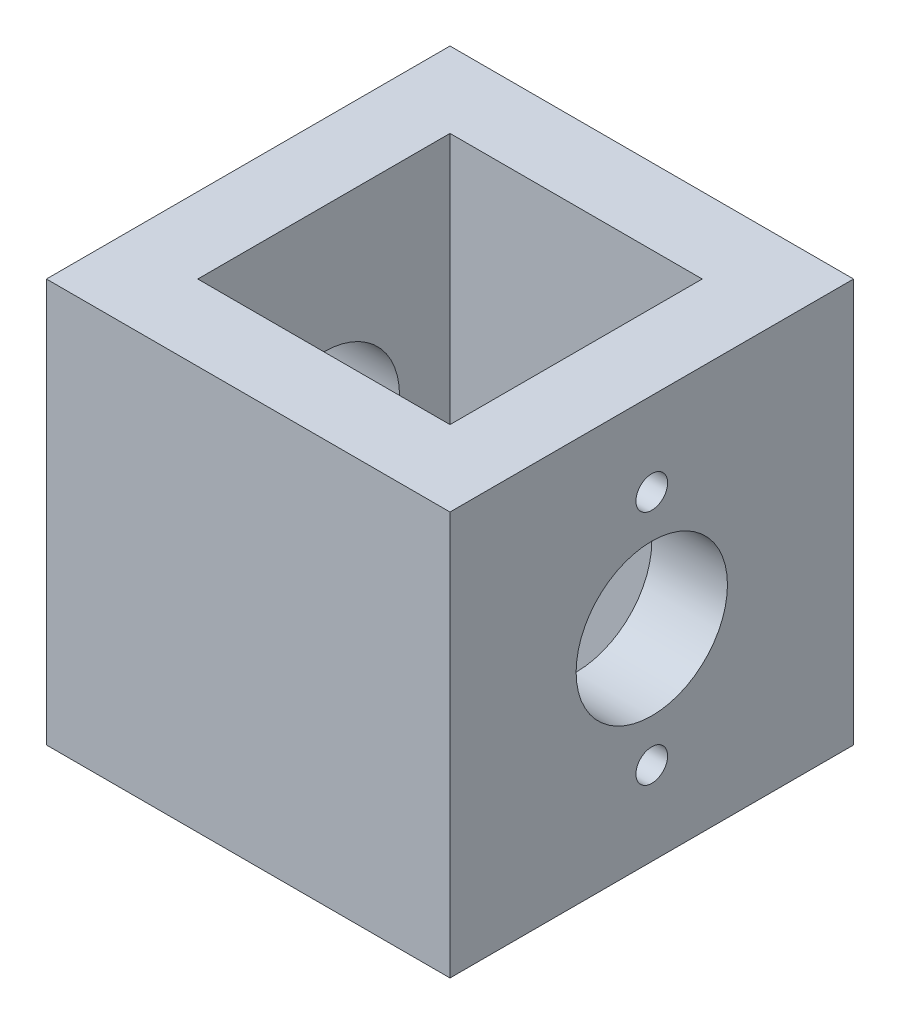
ISO-10303-21;
HEADER;
FILE_DESCRIPTION(('STEP AP214'),'2;1');
FILE_NAME('part.step','',(''),(''),'','','');
FILE_SCHEMA(('AUTOMOTIVE_DESIGN { 1 0 10303 214 1 1 1 1 }'));
ENDSEC;
DATA;
#1=APPLICATION_CONTEXT('core data for automotive mechanical design processes');
#2=APPLICATION_PROTOCOL_DEFINITION('international standard','automotive_design',2000,#1);
#3=PRODUCT_CONTEXT('',#1,'mechanical');
#4=PRODUCT('Part','Part','',(#3));
#5=PRODUCT_RELATED_PRODUCT_CATEGORY('part','',(#4));
#6=PRODUCT_DEFINITION_FORMATION('','',#4);
#7=PRODUCT_DEFINITION_CONTEXT('part definition',#1,'design');
#8=PRODUCT_DEFINITION('design','',#6,#7);
#9=PRODUCT_DEFINITION_SHAPE('','',#8);
#10=(LENGTH_UNIT() NAMED_UNIT(*) SI_UNIT(.MILLI.,.METRE.));
#11=(NAMED_UNIT(*) PLANE_ANGLE_UNIT() SI_UNIT($,.RADIAN.));
#12=(NAMED_UNIT(*) SI_UNIT($,.STERADIAN.) SOLID_ANGLE_UNIT());
#13=UNCERTAINTY_MEASURE_WITH_UNIT(LENGTH_MEASURE(1.E-05),#10,'distance_accuracy_value','');
#14=(GEOMETRIC_REPRESENTATION_CONTEXT(3) GLOBAL_UNCERTAINTY_ASSIGNED_CONTEXT((#13)) GLOBAL_UNIT_ASSIGNED_CONTEXT((#10,
#11,#12)) REPRESENTATION_CONTEXT('',''));
#15=CARTESIAN_POINT('',(0.,0.,0.));
#16=DIRECTION('',(0.,0.,1.));
#17=DIRECTION('',(1.,0.,0.));
#18=AXIS2_PLACEMENT_3D('',#15,#16,#17);
#19=CARTESIAN_POINT('',(0.,25.4,0.));
#20=DIRECTION('',(1.,0.,0.));
#21=DIRECTION('',(0.,0.,-1.));
#22=AXIS2_PLACEMENT_3D('',#19,#20,#21);
#23=PLANE('',#22);
#24=CARTESIAN_POINT('',(0.,12.7,-12.7));
#25=DIRECTION('',(1.,0.,0.));
#26=DIRECTION('',(0.,0.,-1.));
#27=AXIS2_PLACEMENT_3D('',#24,#25,#26);
#28=CIRCLE('',#27,4.7625);
#29=CARTESIAN_POINT('',(0.,12.7,-17.4625));
#30=VERTEX_POINT('',#29);
#31=EDGE_CURVE('E308',#30,#30,#28,.T.);
#32=ORIENTED_EDGE('',*,*,#31,.T.);
#33=EDGE_LOOP('',(#32));
#34=FACE_BOUND('',#33,.T.);
#35=DIRECTION('',(0.,0.,1.));
#36=VECTOR('',#35,1.);
#37=CARTESIAN_POINT('',(0.,0.,0.));
#38=LINE('',#37,#36);
#39=CARTESIAN_POINT('',(0.,0.,-25.4));
#40=VERTEX_POINT('',#39);
#41=CARTESIAN_POINT('',(0.,0.,0.));
#42=VERTEX_POINT('',#41);
#43=EDGE_CURVE('E166',#40,#42,#38,.T.);
#44=ORIENTED_EDGE('',*,*,#43,.T.);
#45=DIRECTION('',(0.,-1.,0.));
#46=VECTOR('',#45,1.);
#47=CARTESIAN_POINT('',(0.,25.4,0.));
#48=LINE('',#47,#46);
#49=CARTESIAN_POINT('',(0.,25.4,0.));
#50=VERTEX_POINT('',#49);
#51=EDGE_CURVE('E11',#50,#42,#48,.T.);
#52=ORIENTED_EDGE('',*,*,#51,.F.);
#53=DIRECTION('',(0.,0.,1.));
#54=VECTOR('',#53,1.);
#55=CARTESIAN_POINT('',(0.,25.4,0.));
#56=LINE('',#55,#54);
#57=CARTESIAN_POINT('',(0.,25.4,-25.4));
#58=VERTEX_POINT('',#57);
#59=EDGE_CURVE('E172',#58,#50,#56,.T.);
#60=ORIENTED_EDGE('',*,*,#59,.F.);
#61=DIRECTION('',(0.,-1.,0.));
#62=VECTOR('',#61,1.);
#63=CARTESIAN_POINT('',(0.,25.4,-25.4));
#64=LINE('',#63,#62);
#65=EDGE_CURVE('E182',#58,#40,#64,.T.);
#66=ORIENTED_EDGE('',*,*,#65,.T.);
#67=EDGE_LOOP('',(#44,#52,#60,#66));
#68=FACE_BOUND('',#67,.T.);
#69=ADVANCED_FACE('F33',(#34,#68),#23,.F.);
#70=CARTESIAN_POINT('',(0.,25.4,0.));
#71=DIRECTION('',(0.,0.,-1.));
#72=DIRECTION('',(-1.,0.,0.));
#73=AXIS2_PLACEMENT_3D('',#70,#71,#72);
#74=PLANE('',#73);
#75=DIRECTION('',(1.,0.,0.));
#76=VECTOR('',#75,1.);
#77=CARTESIAN_POINT('',(0.,0.,0.));
#78=LINE('',#77,#76);
#79=CARTESIAN_POINT('',(25.4,0.,0.));
#80=VERTEX_POINT('',#79);
#81=EDGE_CURVE('E185',#42,#80,#78,.T.);
#82=ORIENTED_EDGE('',*,*,#81,.T.);
#83=DIRECTION('',(0.,-1.,0.));
#84=VECTOR('',#83,1.);
#85=CARTESIAN_POINT('',(25.4,25.4,0.));
#86=LINE('',#85,#84);
#87=CARTESIAN_POINT('',(25.4,25.4,0.));
#88=VERTEX_POINT('',#87);
#89=EDGE_CURVE('E41',#88,#80,#86,.T.);
#90=ORIENTED_EDGE('',*,*,#89,.F.);
#91=DIRECTION('',(1.,0.,0.));
#92=VECTOR('',#91,1.);
#93=CARTESIAN_POINT('',(0.,25.4,0.));
#94=LINE('',#93,#92);
#95=EDGE_CURVE('E175',#50,#88,#94,.T.);
#96=ORIENTED_EDGE('',*,*,#95,.F.);
#97=ORIENTED_EDGE('',*,*,#51,.T.);
#98=EDGE_LOOP('',(#82,#90,#96,#97));
#99=FACE_BOUND('',#98,.T.);
#100=ADVANCED_FACE('F216',(#99),#74,.F.);
#101=CARTESIAN_POINT('',(25.4,25.4,0.));
#102=DIRECTION('',(-1.,0.,0.));
#103=DIRECTION('',(0.,0.,1.));
#104=AXIS2_PLACEMENT_3D('',#101,#102,#103);
#105=PLANE('',#104);
#106=CARTESIAN_POINT('',(25.4,20.1422,-12.7));
#107=DIRECTION('',(1.,0.,0.));
#108=DIRECTION('',(0.,0.,-1.));
#109=AXIS2_PLACEMENT_3D('',#106,#107,#108);
#110=CIRCLE('',#109,0.99694999999999);
#111=CARTESIAN_POINT('',(25.4,20.1422,-13.69695));
#112=VERTEX_POINT('',#111);
#113=EDGE_CURVE('E295',#112,#112,#110,.T.);
#114=ORIENTED_EDGE('',*,*,#113,.F.);
#115=EDGE_LOOP('',(#114));
#116=FACE_BOUND('',#115,.T.);
#117=CARTESIAN_POINT('',(25.4,5.2578,-12.7));
#118=DIRECTION('',(1.,0.,0.));
#119=DIRECTION('',(0.,0.,-1.));
#120=AXIS2_PLACEMENT_3D('',#117,#118,#119);
#121=CIRCLE('',#120,0.996949999999988);
#122=CARTESIAN_POINT('',(25.4,5.2578,-13.69695));
#123=VERTEX_POINT('',#122);
#124=EDGE_CURVE('E297',#123,#123,#121,.T.);
#125=ORIENTED_EDGE('',*,*,#124,.F.);
#126=EDGE_LOOP('',(#125));
#127=FACE_BOUND('',#126,.T.);
#128=CARTESIAN_POINT('',(25.4,12.7,-12.7));
#129=DIRECTION('',(1.,0.,0.));
#130=DIRECTION('',(0.,0.,-1.));
#131=AXIS2_PLACEMENT_3D('',#128,#129,#130);
#132=CIRCLE('',#131,4.76249999999999);
#133=CARTESIAN_POINT('',(25.4,12.7,-17.4625));
#134=VERTEX_POINT('',#133);
#135=EDGE_CURVE('E305',#134,#134,#132,.T.);
#136=ORIENTED_EDGE('',*,*,#135,.F.);
#137=EDGE_LOOP('',(#136));
#138=FACE_BOUND('',#137,.T.);
#139=DIRECTION('',(0.,0.,-1.));
#140=VECTOR('',#139,1.);
#141=CARTESIAN_POINT('',(25.4,0.,0.));
#142=LINE('',#141,#140);
#143=CARTESIAN_POINT('',(25.4,0.,-25.4));
#144=VERTEX_POINT('',#143);
#145=EDGE_CURVE('E187',#80,#144,#142,.T.);
#146=ORIENTED_EDGE('',*,*,#145,.T.);
#147=DIRECTION('',(0.,-1.,0.));
#148=VECTOR('',#147,1.);
#149=CARTESIAN_POINT('',(25.4,25.4,-25.4));
#150=LINE('',#149,#148);
#151=CARTESIAN_POINT('',(25.4,25.4,-25.4));
#152=VERTEX_POINT('',#151);
#153=EDGE_CURVE('E192',#152,#144,#150,.T.);
#154=ORIENTED_EDGE('',*,*,#153,.F.);
#155=DIRECTION('',(0.,0.,-1.));
#156=VECTOR('',#155,1.);
#157=CARTESIAN_POINT('',(25.4,25.4,0.));
#158=LINE('',#157,#156);
#159=EDGE_CURVE('E178',#88,#152,#158,.T.);
#160=ORIENTED_EDGE('',*,*,#159,.F.);
#161=ORIENTED_EDGE('',*,*,#89,.T.);
#162=EDGE_LOOP('',(#146,#154,#160,#161));
#163=FACE_BOUND('',#162,.T.);
#164=ADVANCED_FACE('F200',(#116,#127,#138,#163),#105,.F.);
#165=CARTESIAN_POINT('',(0.,25.4,-25.4));
#166=DIRECTION('',(0.,0.,1.));
#167=DIRECTION('',(1.,0.,0.));
#168=AXIS2_PLACEMENT_3D('',#165,#166,#167);
#169=PLANE('',#168);
#170=DIRECTION('',(-1.,0.,0.));
#171=VECTOR('',#170,1.);
#172=CARTESIAN_POINT('',(0.,0.,-25.4));
#173=LINE('',#172,#171);
#174=EDGE_CURVE('E176',#144,#40,#173,.T.);
#175=ORIENTED_EDGE('',*,*,#174,.T.);
#176=ORIENTED_EDGE('',*,*,#65,.F.);
#177=DIRECTION('',(-1.,0.,0.));
#178=VECTOR('',#177,1.);
#179=CARTESIAN_POINT('',(0.,25.4,-25.4));
#180=LINE('',#179,#178);
#181=EDGE_CURVE('E180',#152,#58,#180,.T.);
#182=ORIENTED_EDGE('',*,*,#181,.F.);
#183=ORIENTED_EDGE('',*,*,#153,.T.);
#184=EDGE_LOOP('',(#175,#176,#182,#183));
#185=FACE_BOUND('',#184,.T.);
#186=ADVANCED_FACE('F209',(#185),#169,.F.);
#187=CARTESIAN_POINT('',(0.,25.4,0.));
#188=DIRECTION('',(0.,-1.,0.));
#189=DIRECTION('',(0.,0.,-1.));
#190=AXIS2_PLACEMENT_3D('',#187,#188,#189);
#191=PLANE('',#190);
#192=DIRECTION('',(-1.,0.,0.));
#193=VECTOR('',#192,1.);
#194=CARTESIAN_POINT('',(4.7625,25.4,-20.6375));
#195=LINE('',#194,#193);
#196=CARTESIAN_POINT('',(20.6375,25.4,-20.6375));
#197=VERTEX_POINT('',#196);
#198=CARTESIAN_POINT('',(4.7625,25.4,-20.6375));
#199=VERTEX_POINT('',#198);
#200=EDGE_CURVE('E156',#197,#199,#195,.T.);
#201=ORIENTED_EDGE('',*,*,#200,.F.);
#202=DIRECTION('',(0.,0.,-1.));
#203=VECTOR('',#202,1.);
#204=CARTESIAN_POINT('',(20.6375,25.4,-4.7625));
#205=LINE('',#204,#203);
#206=CARTESIAN_POINT('',(20.6375,25.4,-4.7625));
#207=VERTEX_POINT('',#206);
#208=EDGE_CURVE('E48',#207,#197,#205,.T.);
#209=ORIENTED_EDGE('',*,*,#208,.F.);
#210=DIRECTION('',(1.,0.,0.));
#211=VECTOR('',#210,1.);
#212=CARTESIAN_POINT('',(4.7625,25.4,-4.7625));
#213=LINE('',#212,#211);
#214=CARTESIAN_POINT('',(4.7625,25.4,-4.7625));
#215=VERTEX_POINT('',#214);
#216=EDGE_CURVE('E147',#215,#207,#213,.T.);
#217=ORIENTED_EDGE('',*,*,#216,.F.);
#218=DIRECTION('',(0.,0.,1.));
#219=VECTOR('',#218,1.);
#220=CARTESIAN_POINT('',(4.7625,25.4,-4.7625));
#221=LINE('',#220,#219);
#222=EDGE_CURVE('E159',#199,#215,#221,.T.);
#223=ORIENTED_EDGE('',*,*,#222,.F.);
#224=EDGE_LOOP('',(#201,#209,#217,#223));
#225=FACE_BOUND('',#224,.T.);
#226=ORIENTED_EDGE('',*,*,#59,.T.);
#227=ORIENTED_EDGE('',*,*,#95,.T.);
#228=ORIENTED_EDGE('',*,*,#159,.T.);
#229=ORIENTED_EDGE('',*,*,#181,.T.);
#230=EDGE_LOOP('',(#226,#227,#228,#229));
#231=FACE_BOUND('',#230,.T.);
#232=ADVANCED_FACE('F215',(#225,#231),#191,.F.);
#233=CARTESIAN_POINT('',(0.,0.,0.));
#234=DIRECTION('',(0.,-1.,0.));
#235=DIRECTION('',(0.,0.,-1.));
#236=AXIS2_PLACEMENT_3D('',#233,#234,#235);
#237=PLANE('',#236);
#238=CARTESIAN_POINT('',(2.54,0.,-2.54));
#239=DIRECTION('',(0.,-1.,0.));
#240=DIRECTION('',(0.,0.,-1.));
#241=AXIS2_PLACEMENT_3D('',#238,#239,#240);
#242=CIRCLE('',#241,1.13029999999999);
#243=CARTESIAN_POINT('',(2.54,0.,-3.67029999999999));
#244=VERTEX_POINT('',#243);
#245=EDGE_CURVE('E119',#244,#244,#242,.T.);
#246=ORIENTED_EDGE('',*,*,#245,.F.);
#247=EDGE_LOOP('',(#246));
#248=FACE_BOUND('',#247,.T.);
#249=CARTESIAN_POINT('',(22.86,0.,-2.54));
#250=DIRECTION('',(0.,-1.,0.));
#251=DIRECTION('',(0.,0.,-1.));
#252=AXIS2_PLACEMENT_3D('',#249,#250,#251);
#253=CIRCLE('',#252,1.13029999999999);
#254=CARTESIAN_POINT('',(22.86,0.,-3.67029999999999));
#255=VERTEX_POINT('',#254);
#256=EDGE_CURVE('E118',#255,#255,#253,.T.);
#257=ORIENTED_EDGE('',*,*,#256,.F.);
#258=EDGE_LOOP('',(#257));
#259=FACE_BOUND('',#258,.T.);
#260=CARTESIAN_POINT('',(22.86,0.,-22.86));
#261=DIRECTION('',(0.,-1.,0.));
#262=DIRECTION('',(0.,0.,-1.));
#263=AXIS2_PLACEMENT_3D('',#260,#261,#262);
#264=CIRCLE('',#263,1.13029999999999);
#265=CARTESIAN_POINT('',(22.86,0.,-23.9903));
#266=VERTEX_POINT('',#265);
#267=EDGE_CURVE('E131',#266,#266,#264,.T.);
#268=ORIENTED_EDGE('',*,*,#267,.F.);
#269=EDGE_LOOP('',(#268));
#270=FACE_BOUND('',#269,.T.);
#271=CARTESIAN_POINT('',(2.54,0.,-22.86));
#272=DIRECTION('',(0.,-1.,0.));
#273=DIRECTION('',(0.,0.,-1.));
#274=AXIS2_PLACEMENT_3D('',#271,#272,#273);
#275=CIRCLE('',#274,1.13029999999999);
#276=CARTESIAN_POINT('',(2.54,0.,-23.9903));
#277=VERTEX_POINT('',#276);
#278=EDGE_CURVE('E137',#277,#277,#275,.T.);
#279=ORIENTED_EDGE('',*,*,#278,.F.);
#280=EDGE_LOOP('',(#279));
#281=FACE_BOUND('',#280,.T.);
#282=DIRECTION('',(0.,0.,-1.));
#283=VECTOR('',#282,1.);
#284=CARTESIAN_POINT('',(20.6375,0.,-4.7625));
#285=LINE('',#284,#283);
#286=CARTESIAN_POINT('',(20.6375,0.,-4.7625));
#287=VERTEX_POINT('',#286);
#288=CARTESIAN_POINT('',(20.6375,0.,-20.6375));
#289=VERTEX_POINT('',#288);
#290=EDGE_CURVE('E143',#287,#289,#285,.T.);
#291=ORIENTED_EDGE('',*,*,#290,.T.);
#292=DIRECTION('',(-1.,0.,0.));
#293=VECTOR('',#292,1.);
#294=CARTESIAN_POINT('',(4.7625,0.,-20.6375));
#295=LINE('',#294,#293);
#296=CARTESIAN_POINT('',(4.7625,0.,-20.6375));
#297=VERTEX_POINT('',#296);
#298=EDGE_CURVE('E146',#289,#297,#295,.T.);
#299=ORIENTED_EDGE('',*,*,#298,.T.);
#300=DIRECTION('',(0.,0.,1.));
#301=VECTOR('',#300,1.);
#302=CARTESIAN_POINT('',(4.7625,0.,-4.7625));
#303=LINE('',#302,#301);
#304=CARTESIAN_POINT('',(4.7625,0.,-4.7625));
#305=VERTEX_POINT('',#304);
#306=EDGE_CURVE('E56',#297,#305,#303,.T.);
#307=ORIENTED_EDGE('',*,*,#306,.T.);
#308=DIRECTION('',(1.,0.,0.));
#309=VECTOR('',#308,1.);
#310=CARTESIAN_POINT('',(4.7625,0.,-4.7625));
#311=LINE('',#310,#309);
#312=EDGE_CURVE('E151',#305,#287,#311,.T.);
#313=ORIENTED_EDGE('',*,*,#312,.T.);
#314=EDGE_LOOP('',(#291,#299,#307,#313));
#315=FACE_BOUND('',#314,.T.);
#316=ORIENTED_EDGE('',*,*,#43,.F.);
#317=ORIENTED_EDGE('',*,*,#174,.F.);
#318=ORIENTED_EDGE('',*,*,#145,.F.);
#319=ORIENTED_EDGE('',*,*,#81,.F.);
#320=EDGE_LOOP('',(#316,#317,#318,#319));
#321=FACE_BOUND('',#320,.T.);
#322=ADVANCED_FACE('F206',(#248,#259,#270,#281,#315,#321),#237,.T.);
#323=CARTESIAN_POINT('',(20.6375,0.,-4.7625));
#324=DIRECTION('',(1.,0.,0.));
#325=DIRECTION('',(0.,0.,-1.));
#326=AXIS2_PLACEMENT_3D('',#323,#324,#325);
#327=PLANE('',#326);
#328=CARTESIAN_POINT('',(20.6375,20.1422,-12.7));
#329=DIRECTION('',(1.,0.,0.));
#330=DIRECTION('',(0.,0.,-1.));
#331=AXIS2_PLACEMENT_3D('',#328,#329,#330);
#332=CIRCLE('',#331,0.996949999999995);
#333=CARTESIAN_POINT('',(20.6375,20.1422,-13.69695));
#334=VERTEX_POINT('',#333);
#335=EDGE_CURVE('E292',#334,#334,#332,.T.);
#336=ORIENTED_EDGE('',*,*,#335,.T.);
#337=EDGE_LOOP('',(#336));
#338=FACE_BOUND('',#337,.T.);
#339=CARTESIAN_POINT('',(20.6375,5.2578,-12.7));
#340=DIRECTION('',(1.,0.,0.));
#341=DIRECTION('',(0.,0.,-1.));
#342=AXIS2_PLACEMENT_3D('',#339,#340,#341);
#343=CIRCLE('',#342,0.996949999999993);
#344=CARTESIAN_POINT('',(20.6375,5.2578,-13.69695));
#345=VERTEX_POINT('',#344);
#346=EDGE_CURVE('E302',#345,#345,#343,.T.);
#347=ORIENTED_EDGE('',*,*,#346,.T.);
#348=EDGE_LOOP('',(#347));
#349=FACE_BOUND('',#348,.T.);
#350=CARTESIAN_POINT('',(20.6375,12.7,-12.7));
#351=DIRECTION('',(1.,0.,0.));
#352=DIRECTION('',(0.,0.,-1.));
#353=AXIS2_PLACEMENT_3D('',#350,#351,#352);
#354=CIRCLE('',#353,4.76249999999999);
#355=CARTESIAN_POINT('',(20.6375,12.7,-17.4625));
#356=VERTEX_POINT('',#355);
#357=EDGE_CURVE('E36',#356,#356,#354,.T.);
#358=ORIENTED_EDGE('',*,*,#357,.T.);
#359=EDGE_LOOP('',(#358));
#360=FACE_BOUND('',#359,.T.);
#361=ORIENTED_EDGE('',*,*,#208,.T.);
#362=DIRECTION('',(0.,1.,0.));
#363=VECTOR('',#362,1.);
#364=CARTESIAN_POINT('',(20.6375,0.,-20.6375));
#365=LINE('',#364,#363);
#366=EDGE_CURVE('E154',#289,#197,#365,.T.);
#367=ORIENTED_EDGE('',*,*,#366,.F.);
#368=ORIENTED_EDGE('',*,*,#290,.F.);
#369=DIRECTION('',(0.,1.,0.));
#370=VECTOR('',#369,1.);
#371=CARTESIAN_POINT('',(20.6375,0.,-4.7625));
#372=LINE('',#371,#370);
#373=EDGE_CURVE('E164',#287,#207,#372,.T.);
#374=ORIENTED_EDGE('',*,*,#373,.T.);
#375=EDGE_LOOP('',(#361,#367,#368,#374));
#376=FACE_BOUND('',#375,.T.);
#377=ADVANCED_FACE('F230',(#338,#349,#360,#376),#327,.F.);
#378=CARTESIAN_POINT('',(4.7625,0.,-4.7625));
#379=DIRECTION('',(0.,0.,1.));
#380=DIRECTION('',(1.,0.,0.));
#381=AXIS2_PLACEMENT_3D('',#378,#379,#380);
#382=PLANE('',#381);
#383=ORIENTED_EDGE('',*,*,#216,.T.);
#384=ORIENTED_EDGE('',*,*,#373,.F.);
#385=ORIENTED_EDGE('',*,*,#312,.F.);
#386=DIRECTION('',(0.,1.,0.));
#387=VECTOR('',#386,1.);
#388=CARTESIAN_POINT('',(4.7625,0.,-4.7625));
#389=LINE('',#388,#387);
#390=EDGE_CURVE('E167',#305,#215,#389,.T.);
#391=ORIENTED_EDGE('',*,*,#390,.T.);
#392=EDGE_LOOP('',(#383,#384,#385,#391));
#393=FACE_BOUND('',#392,.T.);
#394=ADVANCED_FACE('F237',(#393),#382,.F.);
#395=CARTESIAN_POINT('',(4.7625,0.,-4.7625));
#396=DIRECTION('',(-1.,0.,0.));
#397=DIRECTION('',(0.,0.,1.));
#398=AXIS2_PLACEMENT_3D('',#395,#396,#397);
#399=PLANE('',#398);
#400=CARTESIAN_POINT('',(4.7625,12.7,-12.7));
#401=DIRECTION('',(-1.,0.,0.));
#402=DIRECTION('',(0.,0.,1.));
#403=AXIS2_PLACEMENT_3D('',#400,#401,#402);
#404=CIRCLE('',#403,4.76249999999999);
#405=CARTESIAN_POINT('',(4.7625,12.7,-7.93750000000001));
#406=VERTEX_POINT('',#405);
#407=EDGE_CURVE('E125',#406,#406,#404,.T.);
#408=ORIENTED_EDGE('',*,*,#407,.T.);
#409=EDGE_LOOP('',(#408));
#410=FACE_BOUND('',#409,.T.);
#411=ORIENTED_EDGE('',*,*,#222,.T.);
#412=ORIENTED_EDGE('',*,*,#390,.F.);
#413=ORIENTED_EDGE('',*,*,#306,.F.);
#414=DIRECTION('',(0.,1.,0.));
#415=VECTOR('',#414,1.);
#416=CARTESIAN_POINT('',(4.7625,0.,-20.6375));
#417=LINE('',#416,#415);
#418=EDGE_CURVE('E169',#297,#199,#417,.T.);
#419=ORIENTED_EDGE('',*,*,#418,.T.);
#420=EDGE_LOOP('',(#411,#412,#413,#419));
#421=FACE_BOUND('',#420,.T.);
#422=ADVANCED_FACE('F243',(#410,#421),#399,.F.);
#423=CARTESIAN_POINT('',(4.7625,0.,-20.6375));
#424=DIRECTION('',(0.,0.,-1.));
#425=DIRECTION('',(-1.,0.,0.));
#426=AXIS2_PLACEMENT_3D('',#423,#424,#425);
#427=PLANE('',#426);
#428=ORIENTED_EDGE('',*,*,#200,.T.);
#429=ORIENTED_EDGE('',*,*,#418,.F.);
#430=ORIENTED_EDGE('',*,*,#298,.F.);
#431=ORIENTED_EDGE('',*,*,#366,.T.);
#432=EDGE_LOOP('',(#428,#429,#430,#431));
#433=FACE_BOUND('',#432,.T.);
#434=ADVANCED_FACE('F239',(#433),#427,.F.);
#435=CARTESIAN_POINT('',(2.54,10.7188,-22.86));
#436=DIRECTION('',(0.,-1.,0.));
#437=DIRECTION('',(0.,0.,-1.));
#438=AXIS2_PLACEMENT_3D('',#435,#436,#437);
#439=CONICAL_SURFACE('',#438,1.1303,1.02974425867665);
#440=CARTESIAN_POINT('',(2.54,11.3979527576869,-22.86));
#441=VERTEX_POINT('',#440);
#442=VERTEX_LOOP('',#441);
#443=FACE_BOUND('',#442,.T.);
#444=CARTESIAN_POINT('',(2.54,10.7188,-22.86));
#445=DIRECTION('',(0.,-1.,0.));
#446=DIRECTION('',(0.,0.,-1.));
#447=AXIS2_PLACEMENT_3D('',#444,#445,#446);
#448=CIRCLE('',#447,1.1303);
#449=CARTESIAN_POINT('',(2.54,10.7188,-23.9903));
#450=VERTEX_POINT('',#449);
#451=EDGE_CURVE('E140',#450,#450,#448,.T.);
#452=ORIENTED_EDGE('',*,*,#451,.T.);
#453=EDGE_LOOP('',(#452));
#454=FACE_BOUND('',#453,.T.);
#455=ADVANCED_FACE('F242',(#443,#454),#439,.F.);
#456=CARTESIAN_POINT('',(2.54,0.,-22.86));
#457=DIRECTION('',(0.,-1.,0.));
#458=DIRECTION('',(0.,0.,-1.));
#459=AXIS2_PLACEMENT_3D('',#456,#457,#458);
#460=CYLINDRICAL_SURFACE('',#459,1.13029999999999);
#461=ORIENTED_EDGE('',*,*,#451,.F.);
#462=EDGE_LOOP('',(#461));
#463=FACE_BOUND('',#462,.T.);
#464=ORIENTED_EDGE('',*,*,#278,.T.);
#465=EDGE_LOOP('',(#464));
#466=FACE_BOUND('',#465,.T.);
#467=ADVANCED_FACE('F253',(#463,#466),#460,.F.);
#468=CARTESIAN_POINT('',(22.86,10.7188,-22.86));
#469=DIRECTION('',(0.,-1.,0.));
#470=DIRECTION('',(0.,0.,-1.));
#471=AXIS2_PLACEMENT_3D('',#468,#469,#470);
#472=CONICAL_SURFACE('',#471,1.1303,1.02974425867665);
#473=CARTESIAN_POINT('',(22.86,11.3979527576869,-22.86));
#474=VERTEX_POINT('',#473);
#475=VERTEX_LOOP('',#474);
#476=FACE_BOUND('',#475,.T.);
#477=CARTESIAN_POINT('',(22.86,10.7188,-22.86));
#478=DIRECTION('',(0.,-1.,0.));
#479=DIRECTION('',(0.,0.,-1.));
#480=AXIS2_PLACEMENT_3D('',#477,#478,#479);
#481=CIRCLE('',#480,1.1303);
#482=CARTESIAN_POINT('',(22.86,10.7188,-23.9903));
#483=VERTEX_POINT('',#482);
#484=EDGE_CURVE('E134',#483,#483,#481,.T.);
#485=ORIENTED_EDGE('',*,*,#484,.T.);
#486=EDGE_LOOP('',(#485));
#487=FACE_BOUND('',#486,.T.);
#488=ADVANCED_FACE('F257',(#476,#487),#472,.F.);
#489=CARTESIAN_POINT('',(22.86,0.,-22.86));
#490=DIRECTION('',(0.,-1.,0.));
#491=DIRECTION('',(0.,0.,-1.));
#492=AXIS2_PLACEMENT_3D('',#489,#490,#491);
#493=CYLINDRICAL_SURFACE('',#492,1.13029999999999);
#494=ORIENTED_EDGE('',*,*,#484,.F.);
#495=EDGE_LOOP('',(#494));
#496=FACE_BOUND('',#495,.T.);
#497=ORIENTED_EDGE('',*,*,#267,.T.);
#498=EDGE_LOOP('',(#497));
#499=FACE_BOUND('',#498,.T.);
#500=ADVANCED_FACE('F261',(#496,#499),#493,.F.);
#501=CARTESIAN_POINT('',(22.86,10.7188,-2.54));
#502=DIRECTION('',(0.,-1.,0.));
#503=DIRECTION('',(0.,0.,-1.));
#504=AXIS2_PLACEMENT_3D('',#501,#502,#503);
#505=CONICAL_SURFACE('',#504,1.1303,1.02974425867665);
#506=CARTESIAN_POINT('',(22.86,11.3979527576869,-2.54));
#507=VERTEX_POINT('',#506);
#508=VERTEX_LOOP('',#507);
#509=FACE_BOUND('',#508,.T.);
#510=CARTESIAN_POINT('',(22.86,10.7188,-2.54));
#511=DIRECTION('',(0.,-1.,0.));
#512=DIRECTION('',(0.,0.,-1.));
#513=AXIS2_PLACEMENT_3D('',#510,#511,#512);
#514=CIRCLE('',#513,1.1303);
#515=CARTESIAN_POINT('',(22.86,10.7188,-3.6703));
#516=VERTEX_POINT('',#515);
#517=EDGE_CURVE('E122',#516,#516,#514,.T.);
#518=ORIENTED_EDGE('',*,*,#517,.T.);
#519=EDGE_LOOP('',(#518));
#520=FACE_BOUND('',#519,.T.);
#521=ADVANCED_FACE('F265',(#509,#520),#505,.F.);
#522=CARTESIAN_POINT('',(22.86,0.,-2.54));
#523=DIRECTION('',(0.,-1.,0.));
#524=DIRECTION('',(0.,0.,-1.));
#525=AXIS2_PLACEMENT_3D('',#522,#523,#524);
#526=CYLINDRICAL_SURFACE('',#525,1.13029999999999);
#527=ORIENTED_EDGE('',*,*,#517,.F.);
#528=EDGE_LOOP('',(#527));
#529=FACE_BOUND('',#528,.T.);
#530=ORIENTED_EDGE('',*,*,#256,.T.);
#531=EDGE_LOOP('',(#530));
#532=FACE_BOUND('',#531,.T.);
#533=ADVANCED_FACE('F112',(#529,#532),#526,.F.);
#534=CARTESIAN_POINT('',(2.54,10.7188,-2.54));
#535=DIRECTION('',(0.,-1.,0.));
#536=DIRECTION('',(0.,0.,-1.));
#537=AXIS2_PLACEMENT_3D('',#534,#535,#536);
#538=CONICAL_SURFACE('',#537,1.1303,1.02974425867665);
#539=CARTESIAN_POINT('',(2.54,11.3979527576869,-2.54));
#540=VERTEX_POINT('',#539);
#541=VERTEX_LOOP('',#540);
#542=FACE_BOUND('',#541,.T.);
#543=CARTESIAN_POINT('',(2.54,10.7188,-2.54));
#544=DIRECTION('',(0.,-1.,0.));
#545=DIRECTION('',(0.,0.,-1.));
#546=AXIS2_PLACEMENT_3D('',#543,#544,#545);
#547=CIRCLE('',#546,1.1303);
#548=CARTESIAN_POINT('',(2.54,10.7188,-3.6703));
#549=VERTEX_POINT('',#548);
#550=EDGE_CURVE('E116',#549,#549,#547,.T.);
#551=ORIENTED_EDGE('',*,*,#550,.T.);
#552=EDGE_LOOP('',(#551));
#553=FACE_BOUND('',#552,.T.);
#554=ADVANCED_FACE('F108',(#542,#553),#538,.F.);
#555=CARTESIAN_POINT('',(2.54,0.,-2.54));
#556=DIRECTION('',(0.,-1.,0.));
#557=DIRECTION('',(0.,0.,-1.));
#558=AXIS2_PLACEMENT_3D('',#555,#556,#557);
#559=CYLINDRICAL_SURFACE('',#558,1.13029999999999);
#560=ORIENTED_EDGE('',*,*,#550,.F.);
#561=EDGE_LOOP('',(#560));
#562=FACE_BOUND('',#561,.T.);
#563=ORIENTED_EDGE('',*,*,#245,.T.);
#564=EDGE_LOOP('',(#563));
#565=FACE_BOUND('',#564,.T.);
#566=ADVANCED_FACE('F111',(#562,#565),#559,.F.);
#567=CARTESIAN_POINT('',(25.4,12.7,-12.7));
#568=DIRECTION('',(1.,0.,0.));
#569=DIRECTION('',(0.,0.,-1.));
#570=AXIS2_PLACEMENT_3D('',#567,#568,#569);
#571=CYLINDRICAL_SURFACE('',#570,4.76249999999999);
#572=ORIENTED_EDGE('',*,*,#135,.T.);
#573=EDGE_LOOP('',(#572));
#574=FACE_BOUND('',#573,.T.);
#575=ORIENTED_EDGE('',*,*,#357,.F.);
#576=EDGE_LOOP('',(#575));
#577=FACE_BOUND('',#576,.T.);
#578=ADVANCED_FACE('F275',(#574,#577),#571,.F.);
#579=ORIENTED_EDGE('',*,*,#31,.F.);
#580=EDGE_LOOP('',(#579));
#581=FACE_BOUND('',#580,.T.);
#582=ORIENTED_EDGE('',*,*,#407,.F.);
#583=EDGE_LOOP('',(#582));
#584=FACE_BOUND('',#583,.T.);
#585=ADVANCED_FACE('F276',(#581,#584),#571,.F.);
#586=CARTESIAN_POINT('',(25.4,5.2578,-12.7));
#587=DIRECTION('',(1.,0.,0.));
#588=DIRECTION('',(0.,0.,-1.));
#589=AXIS2_PLACEMENT_3D('',#586,#587,#588);
#590=CYLINDRICAL_SURFACE('',#589,0.996949999999993);
#591=ORIENTED_EDGE('',*,*,#346,.F.);
#592=EDGE_LOOP('',(#591));
#593=FACE_BOUND('',#592,.T.);
#594=ORIENTED_EDGE('',*,*,#124,.T.);
#595=EDGE_LOOP('',(#594));
#596=FACE_BOUND('',#595,.T.);
#597=ADVANCED_FACE('F279',(#593,#596),#590,.F.);
#598=CARTESIAN_POINT('',(25.4,20.1422,-12.7));
#599=DIRECTION('',(1.,0.,0.));
#600=DIRECTION('',(0.,0.,-1.));
#601=AXIS2_PLACEMENT_3D('',#598,#599,#600);
#602=CYLINDRICAL_SURFACE('',#601,0.996949999999995);
#603=ORIENTED_EDGE('',*,*,#335,.F.);
#604=EDGE_LOOP('',(#603));
#605=FACE_BOUND('',#604,.T.);
#606=ORIENTED_EDGE('',*,*,#113,.T.);
#607=EDGE_LOOP('',(#606));
#608=FACE_BOUND('',#607,.T.);
#609=ADVANCED_FACE('F283',(#605,#608),#602,.F.);
#610=CLOSED_SHELL('',(#69,#100,#164,#186,#232,#322,#377,#394,#422,#434,#455,#467,#488,#500,#521,
#533,#554,#566,#578,#585,#597,#609));
#611=MANIFOLD_SOLID_BREP('B2',#610);
#612=ADVANCED_BREP_SHAPE_REPRESENTATION('',(#18,#611),#14);
#613=SHAPE_DEFINITION_REPRESENTATION(#9,#612);
ENDSEC;
END-ISO-10303-21;
